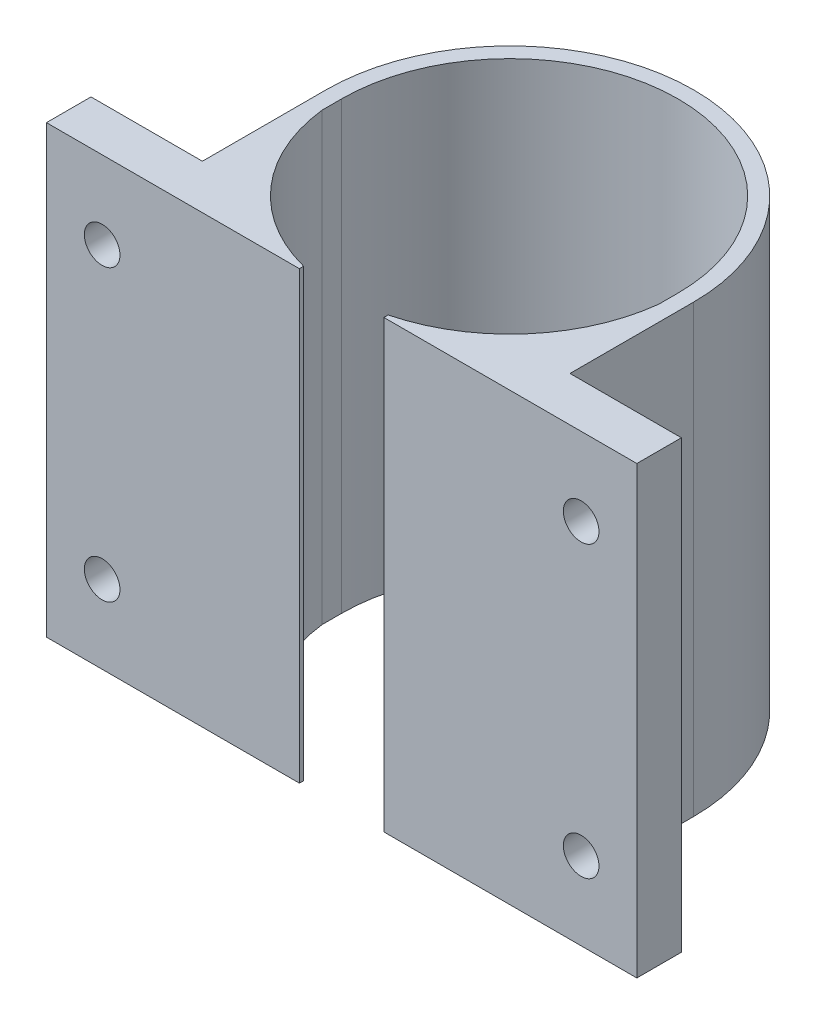
ISO-10303-21;
HEADER;
FILE_DESCRIPTION(('STEP AP214'),'2;1');
FILE_NAME('part.step','',(''),(''),'','','');
FILE_SCHEMA(('AUTOMOTIVE_DESIGN { 1 0 10303 214 1 1 1 1 }'));
ENDSEC;
DATA;
#1=APPLICATION_CONTEXT('core data for automotive mechanical design processes');
#2=APPLICATION_PROTOCOL_DEFINITION('international standard','automotive_design',2000,#1);
#3=PRODUCT_CONTEXT('',#1,'mechanical');
#4=PRODUCT('Part','Part','',(#3));
#5=PRODUCT_RELATED_PRODUCT_CATEGORY('part','',(#4));
#6=PRODUCT_DEFINITION_FORMATION('','',#4);
#7=PRODUCT_DEFINITION_CONTEXT('part definition',#1,'design');
#8=PRODUCT_DEFINITION('design','',#6,#7);
#9=PRODUCT_DEFINITION_SHAPE('','',#8);
#10=(LENGTH_UNIT() NAMED_UNIT(*) SI_UNIT(.MILLI.,.METRE.));
#11=(NAMED_UNIT(*) PLANE_ANGLE_UNIT() SI_UNIT($,.RADIAN.));
#12=(NAMED_UNIT(*) SI_UNIT($,.STERADIAN.) SOLID_ANGLE_UNIT());
#13=UNCERTAINTY_MEASURE_WITH_UNIT(LENGTH_MEASURE(1.E-05),#10,'distance_accuracy_value','');
#14=(GEOMETRIC_REPRESENTATION_CONTEXT(3) GLOBAL_UNCERTAINTY_ASSIGNED_CONTEXT((#13)) GLOBAL_UNIT_ASSIGNED_CONTEXT((#10,
#11,#12)) REPRESENTATION_CONTEXT('',''));
#15=CARTESIAN_POINT('',(0.,0.,0.));
#16=DIRECTION('',(0.,0.,1.));
#17=DIRECTION('',(1.,0.,0.));
#18=AXIS2_PLACEMENT_3D('',#15,#16,#17);
#19=CARTESIAN_POINT('',(-12.08,32.,0.));
#20=DIRECTION('',(1.,0.,0.));
#21=DIRECTION('',(0.,0.,-1.));
#22=AXIS2_PLACEMENT_3D('',#19,#20,#21);
#23=PLANE('',#22);
#24=DIRECTION('',(0.,0.,1.));
#25=VECTOR('',#24,1.);
#26=CARTESIAN_POINT('',(-12.08,32.,0.));
#27=LINE('',#26,#25);
#28=CARTESIAN_POINT('',(-12.08,32.,0.));
#29=VERTEX_POINT('',#28);
#30=CARTESIAN_POINT('',(-12.08,32.,1.39255161484235));
#31=VERTEX_POINT('',#30);
#32=EDGE_CURVE('E297',#29,#31,#27,.T.);
#33=ORIENTED_EDGE('',*,*,#32,.T.);
#34=DIRECTION('',(0.,-1.,0.));
#35=VECTOR('',#34,1.);
#36=CARTESIAN_POINT('',(-12.08,32.,1.39255161484235));
#37=LINE('',#36,#35);
#38=CARTESIAN_POINT('',(-12.08,0.,1.39255161484235));
#39=VERTEX_POINT('',#38);
#40=EDGE_CURVE('E189',#31,#39,#37,.T.);
#41=ORIENTED_EDGE('',*,*,#40,.T.);
#42=DIRECTION('',(0.,0.,1.));
#43=VECTOR('',#42,1.);
#44=CARTESIAN_POINT('',(-12.08,0.,0.));
#45=LINE('',#44,#43);
#46=CARTESIAN_POINT('',(-12.08,0.,0.));
#47=VERTEX_POINT('',#46);
#48=EDGE_CURVE('E322',#47,#39,#45,.T.);
#49=ORIENTED_EDGE('',*,*,#48,.F.);
#50=DIRECTION('',(0.,-1.,0.));
#51=VECTOR('',#50,1.);
#52=CARTESIAN_POINT('',(-12.08,32.,0.));
#53=LINE('',#52,#51);
#54=EDGE_CURVE('E336',#29,#47,#53,.T.);
#55=ORIENTED_EDGE('',*,*,#54,.F.);
#56=EDGE_LOOP('',(#33,#41,#49,#55));
#57=FACE_BOUND('',#56,.T.);
#58=ADVANCED_FACE('F51',(#57),#23,.T.);
#59=CARTESIAN_POINT('',(-13.2,32.,0.));
#60=DIRECTION('',(1.,0.,0.));
#61=DIRECTION('',(0.,0.,-1.));
#62=AXIS2_PLACEMENT_3D('',#59,#60,#61);
#63=PLANE('',#62);
#64=DIRECTION('',(0.,-1.,0.));
#65=VECTOR('',#64,1.);
#66=CARTESIAN_POINT('',(-13.2,32.,8.88));
#67=LINE('',#66,#65);
#68=CARTESIAN_POINT('',(-13.2,32.,8.88));
#69=VERTEX_POINT('',#68);
#70=CARTESIAN_POINT('',(-13.2,0.,8.88));
#71=VERTEX_POINT('',#70);
#72=EDGE_CURVE('E227',#69,#71,#67,.T.);
#73=ORIENTED_EDGE('',*,*,#72,.F.);
#74=DIRECTION('',(0.,0.,1.));
#75=VECTOR('',#74,1.);
#76=CARTESIAN_POINT('',(-13.2,32.,0.));
#77=LINE('',#76,#75);
#78=CARTESIAN_POINT('',(-13.2,32.,0.));
#79=VERTEX_POINT('',#78);
#80=EDGE_CURVE('E291',#79,#69,#77,.T.);
#81=ORIENTED_EDGE('',*,*,#80,.F.);
#82=DIRECTION('',(0.,-1.,0.));
#83=VECTOR('',#82,1.);
#84=CARTESIAN_POINT('',(-13.2,32.,0.));
#85=LINE('',#84,#83);
#86=CARTESIAN_POINT('',(-13.2,0.,0.));
#87=VERTEX_POINT('',#86);
#88=EDGE_CURVE('E60',#79,#87,#85,.T.);
#89=ORIENTED_EDGE('',*,*,#88,.T.);
#90=DIRECTION('',(0.,0.,1.));
#91=VECTOR('',#90,1.);
#92=CARTESIAN_POINT('',(-13.2,0.,0.));
#93=LINE('',#92,#91);
#94=EDGE_CURVE('E316',#87,#71,#93,.T.);
#95=ORIENTED_EDGE('',*,*,#94,.T.);
#96=EDGE_LOOP('',(#73,#81,#89,#95));
#97=FACE_BOUND('',#96,.T.);
#98=ADVANCED_FACE('F344',(#97),#63,.F.);
#99=CARTESIAN_POINT('',(13.2,32.,0.));
#100=DIRECTION('',(-1.,0.,0.));
#101=DIRECTION('',(0.,0.,1.));
#102=AXIS2_PLACEMENT_3D('',#99,#100,#101);
#103=PLANE('',#102);
#104=DIRECTION('',(0.,1.,0.));
#105=VECTOR('',#104,1.);
#106=CARTESIAN_POINT('',(13.2,0.,8.88));
#107=LINE('',#106,#105);
#108=CARTESIAN_POINT('',(13.2,0.,8.88));
#109=VERTEX_POINT('',#108);
#110=CARTESIAN_POINT('',(13.2,32.,8.88));
#111=VERTEX_POINT('',#110);
#112=EDGE_CURVE('E257',#109,#111,#107,.T.);
#113=ORIENTED_EDGE('',*,*,#112,.F.);
#114=DIRECTION('',(0.,0.,-1.));
#115=VECTOR('',#114,1.);
#116=CARTESIAN_POINT('',(13.2,0.,0.));
#117=LINE('',#116,#115);
#118=CARTESIAN_POINT('',(13.2,0.,0.));
#119=VERTEX_POINT('',#118);
#120=EDGE_CURVE('E283',#109,#119,#117,.T.);
#121=ORIENTED_EDGE('',*,*,#120,.T.);
#122=DIRECTION('',(0.,-1.,0.));
#123=VECTOR('',#122,1.);
#124=CARTESIAN_POINT('',(13.2,32.,0.));
#125=LINE('',#124,#123);
#126=CARTESIAN_POINT('',(13.2,32.,0.));
#127=VERTEX_POINT('',#126);
#128=EDGE_CURVE('E12',#127,#119,#125,.T.);
#129=ORIENTED_EDGE('',*,*,#128,.F.);
#130=DIRECTION('',(0.,0.,-1.));
#131=VECTOR('',#130,1.);
#132=CARTESIAN_POINT('',(13.2,32.,0.));
#133=LINE('',#132,#131);
#134=EDGE_CURVE('E284',#111,#127,#133,.T.);
#135=ORIENTED_EDGE('',*,*,#134,.F.);
#136=EDGE_LOOP('',(#113,#121,#129,#135));
#137=FACE_BOUND('',#136,.T.);
#138=ADVANCED_FACE('F53',(#137),#103,.F.);
#139=CARTESIAN_POINT('',(0.,32.,0.));
#140=DIRECTION('',(0.,-1.,0.));
#141=DIRECTION('',(0.,0.,-1.));
#142=AXIS2_PLACEMENT_3D('',#139,#140,#141);
#143=CYLINDRICAL_SURFACE('',#142,13.2);
#144=CARTESIAN_POINT('',(0.,0.,0.));
#145=DIRECTION('',(0.,1.,0.));
#146=DIRECTION('',(0.,0.,1.));
#147=AXIS2_PLACEMENT_3D('',#144,#145,#146);
#148=CIRCLE('',#147,13.2);
#149=EDGE_CURVE('E313',#119,#87,#148,.T.);
#150=ORIENTED_EDGE('',*,*,#149,.T.);
#151=ORIENTED_EDGE('',*,*,#88,.F.);
#152=CARTESIAN_POINT('',(0.,32.,0.));
#153=DIRECTION('',(0.,1.,0.));
#154=DIRECTION('',(0.,0.,1.));
#155=AXIS2_PLACEMENT_3D('',#152,#153,#154);
#156=CIRCLE('',#155,13.2);
#157=EDGE_CURVE('E287',#127,#79,#156,.T.);
#158=ORIENTED_EDGE('',*,*,#157,.F.);
#159=ORIENTED_EDGE('',*,*,#128,.T.);
#160=EDGE_LOOP('',(#150,#151,#158,#159));
#161=FACE_BOUND('',#160,.T.);
#162=ADVANCED_FACE('F357',(#161),#143,.T.);
#163=CARTESIAN_POINT('',(0.,32.,12.08));
#164=DIRECTION('',(0.,0.,1.));
#165=DIRECTION('',(1.,0.,0.));
#166=AXIS2_PLACEMENT_3D('',#163,#164,#165);
#167=PLANE('',#166);
#168=CARTESIAN_POINT('',(-17.2,5.6,12.08));
#169=DIRECTION('',(0.,0.,1.));
#170=DIRECTION('',(1.,0.,0.));
#171=AXIS2_PLACEMENT_3D('',#168,#169,#170);
#172=CIRCLE('',#171,1.28);
#173=CARTESIAN_POINT('',(-15.92,5.6,12.08));
#174=VERTEX_POINT('',#173);
#175=EDGE_CURVE('E456',#174,#174,#172,.T.);
#176=ORIENTED_EDGE('',*,*,#175,.F.);
#177=EDGE_LOOP('',(#176));
#178=FACE_BOUND('',#177,.T.);
#179=CARTESIAN_POINT('',(-17.2,26.4,12.08));
#180=DIRECTION('',(0.,0.,1.));
#181=DIRECTION('',(1.,0.,0.));
#182=AXIS2_PLACEMENT_3D('',#179,#180,#181);
#183=CIRCLE('',#182,1.28);
#184=CARTESIAN_POINT('',(-15.92,26.4,12.08));
#185=VERTEX_POINT('',#184);
#186=EDGE_CURVE('E467',#185,#185,#183,.T.);
#187=ORIENTED_EDGE('',*,*,#186,.F.);
#188=EDGE_LOOP('',(#187));
#189=FACE_BOUND('',#188,.T.);
#190=DIRECTION('',(-1.,0.,0.));
#191=VECTOR('',#190,1.);
#192=CARTESIAN_POINT('',(0.,0.,12.08));
#193=LINE('',#192,#191);
#194=CARTESIAN_POINT('',(-3.03306616692718,0.,12.08));
#195=VERTEX_POINT('',#194);
#196=CARTESIAN_POINT('',(-21.2,0.,12.08));
#197=VERTEX_POINT('',#196);
#198=EDGE_CURVE('E319',#195,#197,#193,.T.);
#199=ORIENTED_EDGE('',*,*,#198,.F.);
#200=DIRECTION('',(0.,-1.,0.));
#201=VECTOR('',#200,1.);
#202=CARTESIAN_POINT('',(-3.03306616692718,32.,12.08));
#203=LINE('',#202,#201);
#204=CARTESIAN_POINT('',(-3.03306616692718,32.,12.08));
#205=VERTEX_POINT('',#204);
#206=EDGE_CURVE('E185',#205,#195,#203,.T.);
#207=ORIENTED_EDGE('',*,*,#206,.F.);
#208=DIRECTION('',(-1.,0.,0.));
#209=VECTOR('',#208,1.);
#210=CARTESIAN_POINT('',(0.,32.,12.08));
#211=LINE('',#210,#209);
#212=CARTESIAN_POINT('',(-21.2,32.,12.08));
#213=VERTEX_POINT('',#212);
#214=EDGE_CURVE('E171',#205,#213,#211,.T.);
#215=ORIENTED_EDGE('',*,*,#214,.T.);
#216=DIRECTION('',(0.,1.,0.));
#217=VECTOR('',#216,1.);
#218=CARTESIAN_POINT('',(-21.2,32.,12.08));
#219=LINE('',#218,#217);
#220=EDGE_CURVE('E232',#197,#213,#219,.T.);
#221=ORIENTED_EDGE('',*,*,#220,.F.);
#222=EDGE_LOOP('',(#199,#207,#215,#221));
#223=FACE_BOUND('',#222,.T.);
#224=ADVANCED_FACE('F392',(#178,#189,#223),#167,.T.);
#225=CARTESIAN_POINT('',(0.,32.,0.));
#226=DIRECTION('',(0.,-1.,0.));
#227=DIRECTION('',(0.,0.,-1.));
#228=AXIS2_PLACEMENT_3D('',#225,#226,#227);
#229=CYLINDRICAL_SURFACE('',#228,12.08);
#230=CARTESIAN_POINT('',(0.,0.,0.));
#231=DIRECTION('',(0.,1.,0.));
#232=DIRECTION('',(0.,0.,1.));
#233=AXIS2_PLACEMENT_3D('',#230,#231,#232);
#234=CIRCLE('',#233,12.08);
#235=CARTESIAN_POINT('',(12.08,0.,0.));
#236=VERTEX_POINT('',#235);
#237=EDGE_CURVE('E326',#236,#47,#234,.T.);
#238=ORIENTED_EDGE('',*,*,#237,.F.);
#239=DIRECTION('',(0.,-1.,0.));
#240=VECTOR('',#239,1.);
#241=CARTESIAN_POINT('',(12.08,32.,0.));
#242=LINE('',#241,#240);
#243=CARTESIAN_POINT('',(12.08,32.,0.));
#244=VERTEX_POINT('',#243);
#245=EDGE_CURVE('E310',#244,#236,#242,.T.);
#246=ORIENTED_EDGE('',*,*,#245,.F.);
#247=CARTESIAN_POINT('',(0.,32.,0.));
#248=DIRECTION('',(0.,1.,0.));
#249=DIRECTION('',(0.,0.,1.));
#250=AXIS2_PLACEMENT_3D('',#247,#248,#249);
#251=CIRCLE('',#250,12.08);
#252=EDGE_CURVE('E300',#244,#29,#251,.T.);
#253=ORIENTED_EDGE('',*,*,#252,.T.);
#254=ORIENTED_EDGE('',*,*,#54,.T.);
#255=EDGE_LOOP('',(#238,#246,#253,#254));
#256=FACE_BOUND('',#255,.T.);
#257=ADVANCED_FACE('F385',(#256),#229,.F.);
#258=CARTESIAN_POINT('',(12.08,32.,0.));
#259=DIRECTION('',(1.,0.,0.));
#260=DIRECTION('',(0.,0.,-1.));
#261=AXIS2_PLACEMENT_3D('',#258,#259,#260);
#262=PLANE('',#261);
#263=DIRECTION('',(0.,0.,1.));
#264=VECTOR('',#263,1.);
#265=CARTESIAN_POINT('',(12.08,0.,0.));
#266=LINE('',#265,#264);
#267=CARTESIAN_POINT('',(12.08,0.,1.39255161484233));
#268=VERTEX_POINT('',#267);
#269=EDGE_CURVE('E72',#236,#268,#266,.T.);
#270=ORIENTED_EDGE('',*,*,#269,.T.);
#271=DIRECTION('',(0.,-1.,0.));
#272=VECTOR('',#271,1.);
#273=CARTESIAN_POINT('',(12.08,32.,1.39255161484235));
#274=LINE('',#273,#272);
#275=CARTESIAN_POINT('',(12.08,32.,1.39255161484233));
#276=VERTEX_POINT('',#275);
#277=EDGE_CURVE('E67',#276,#268,#274,.T.);
#278=ORIENTED_EDGE('',*,*,#277,.F.);
#279=DIRECTION('',(0.,0.,1.));
#280=VECTOR('',#279,1.);
#281=CARTESIAN_POINT('',(12.08,32.,0.));
#282=LINE('',#281,#280);
#283=EDGE_CURVE('E304',#244,#276,#282,.T.);
#284=ORIENTED_EDGE('',*,*,#283,.F.);
#285=ORIENTED_EDGE('',*,*,#245,.T.);
#286=EDGE_LOOP('',(#270,#278,#284,#285));
#287=FACE_BOUND('',#286,.T.);
#288=ADVANCED_FACE('F382',(#287),#262,.F.);
#289=CARTESIAN_POINT('',(0.,32.,12.08));
#290=DIRECTION('',(0.,0.,-1.));
#291=DIRECTION('',(-1.,0.,0.));
#292=AXIS2_PLACEMENT_3D('',#289,#290,#291);
#293=PLANE('',#292);
#294=CARTESIAN_POINT('',(17.2,26.4,12.08));
#295=DIRECTION('',(0.,0.,-1.));
#296=DIRECTION('',(-1.,0.,0.));
#297=AXIS2_PLACEMENT_3D('',#294,#295,#296);
#298=CIRCLE('',#297,1.28);
#299=CARTESIAN_POINT('',(15.92,26.4,12.08));
#300=VERTEX_POINT('',#299);
#301=EDGE_CURVE('E197',#300,#300,#298,.T.);
#302=ORIENTED_EDGE('',*,*,#301,.T.);
#303=EDGE_LOOP('',(#302));
#304=FACE_BOUND('',#303,.T.);
#305=CARTESIAN_POINT('',(17.2,5.6,12.08));
#306=DIRECTION('',(0.,0.,-1.));
#307=DIRECTION('',(-1.,0.,0.));
#308=AXIS2_PLACEMENT_3D('',#305,#306,#307);
#309=CIRCLE('',#308,1.28);
#310=CARTESIAN_POINT('',(15.92,5.6,12.08));
#311=VERTEX_POINT('',#310);
#312=EDGE_CURVE('E480',#311,#311,#309,.T.);
#313=ORIENTED_EDGE('',*,*,#312,.T.);
#314=EDGE_LOOP('',(#313));
#315=FACE_BOUND('',#314,.T.);
#316=DIRECTION('',(1.,0.,0.));
#317=VECTOR('',#316,1.);
#318=CARTESIAN_POINT('',(0.,0.,12.08));
#319=LINE('',#318,#317);
#320=CARTESIAN_POINT('',(3.03306616692718,0.,12.08));
#321=VERTEX_POINT('',#320);
#322=CARTESIAN_POINT('',(21.2,0.,12.08));
#323=VERTEX_POINT('',#322);
#324=EDGE_CURVE('E288',#321,#323,#319,.T.);
#325=ORIENTED_EDGE('',*,*,#324,.T.);
#326=DIRECTION('',(0.,-1.,0.));
#327=VECTOR('',#326,1.);
#328=CARTESIAN_POINT('',(21.2,0.,12.08));
#329=LINE('',#328,#327);
#330=CARTESIAN_POINT('',(21.2,32.,12.08));
#331=VERTEX_POINT('',#330);
#332=EDGE_CURVE('E258',#331,#323,#329,.T.);
#333=ORIENTED_EDGE('',*,*,#332,.F.);
#334=DIRECTION('',(1.,0.,0.));
#335=VECTOR('',#334,1.);
#336=CARTESIAN_POINT('',(0.,32.,12.08));
#337=LINE('',#336,#335);
#338=CARTESIAN_POINT('',(3.03306616692718,32.,12.08));
#339=VERTEX_POINT('',#338);
#340=EDGE_CURVE('E307',#339,#331,#337,.T.);
#341=ORIENTED_EDGE('',*,*,#340,.F.);
#342=DIRECTION('',(0.,-1.,0.));
#343=VECTOR('',#342,1.);
#344=CARTESIAN_POINT('',(3.03306616692718,32.,12.08));
#345=LINE('',#344,#343);
#346=EDGE_CURVE('E223',#339,#321,#345,.T.);
#347=ORIENTED_EDGE('',*,*,#346,.T.);
#348=EDGE_LOOP('',(#325,#333,#341,#347));
#349=FACE_BOUND('',#348,.T.);
#350=ADVANCED_FACE('F371',(#304,#315,#349),#293,.F.);
#351=CARTESIAN_POINT('',(0.,32.,0.));
#352=DIRECTION('',(0.,1.,0.));
#353=DIRECTION('',(0.,0.,1.));
#354=AXIS2_PLACEMENT_3D('',#351,#352,#353);
#355=PLANE('',#354);
#356=ORIENTED_EDGE('',*,*,#340,.T.);
#357=DIRECTION('',(0.,0.,1.));
#358=VECTOR('',#357,1.);
#359=CARTESIAN_POINT('',(21.2,32.,12.08));
#360=LINE('',#359,#358);
#361=CARTESIAN_POINT('',(21.2,32.,8.88));
#362=VERTEX_POINT('',#361);
#363=EDGE_CURVE('E268',#362,#331,#360,.T.);
#364=ORIENTED_EDGE('',*,*,#363,.F.);
#365=DIRECTION('',(-1.,0.,0.));
#366=VECTOR('',#365,1.);
#367=CARTESIAN_POINT('',(21.2,32.,8.88));
#368=LINE('',#367,#366);
#369=EDGE_CURVE('E272',#362,#111,#368,.T.);
#370=ORIENTED_EDGE('',*,*,#369,.T.);
#371=ORIENTED_EDGE('',*,*,#134,.T.);
#372=ORIENTED_EDGE('',*,*,#157,.T.);
#373=ORIENTED_EDGE('',*,*,#80,.T.);
#374=DIRECTION('',(1.,0.,0.));
#375=VECTOR('',#374,1.);
#376=CARTESIAN_POINT('',(-21.2,32.,8.88));
#377=LINE('',#376,#375);
#378=CARTESIAN_POINT('',(-21.2,32.,8.88));
#379=VERTEX_POINT('',#378);
#380=EDGE_CURVE('E253',#379,#69,#377,.T.);
#381=ORIENTED_EDGE('',*,*,#380,.F.);
#382=DIRECTION('',(0.,0.,-1.));
#383=VECTOR('',#382,1.);
#384=CARTESIAN_POINT('',(-21.2,32.,12.08));
#385=LINE('',#384,#383);
#386=EDGE_CURVE('E236',#213,#379,#385,.T.);
#387=ORIENTED_EDGE('',*,*,#386,.F.);
#388=ORIENTED_EDGE('',*,*,#214,.F.);
#389=DIRECTION('',(0.,0.,-1.));
#390=VECTOR('',#389,1.);
#391=CARTESIAN_POINT('',(-3.03306616692718,32.,0.));
#392=LINE('',#391,#390);
#393=CARTESIAN_POINT('',(-3.03306616692718,32.,11.775657502961));
#394=VERTEX_POINT('',#393);
#395=EDGE_CURVE('E163',#205,#394,#392,.T.);
#396=ORIENTED_EDGE('',*,*,#395,.T.);
#397=CARTESIAN_POINT('',(0.,32.,0.));
#398=DIRECTION('',(0.,-1.,0.));
#399=DIRECTION('',(0.,0.,-1.));
#400=AXIS2_PLACEMENT_3D('',#397,#398,#399);
#401=CIRCLE('',#400,12.16);
#402=EDGE_CURVE('E168',#394,#31,#401,.T.);
#403=ORIENTED_EDGE('',*,*,#402,.T.);
#404=ORIENTED_EDGE('',*,*,#32,.F.);
#405=ORIENTED_EDGE('',*,*,#252,.F.);
#406=ORIENTED_EDGE('',*,*,#283,.T.);
#407=CARTESIAN_POINT('',(0.,32.,0.));
#408=DIRECTION('',(0.,-1.,0.));
#409=DIRECTION('',(0.,0.,-1.));
#410=AXIS2_PLACEMENT_3D('',#407,#408,#409);
#411=CIRCLE('',#410,12.16);
#412=CARTESIAN_POINT('',(3.03306616692718,32.,11.775657502961));
#413=VERTEX_POINT('',#412);
#414=EDGE_CURVE('E211',#413,#276,#411,.F.);
#415=ORIENTED_EDGE('',*,*,#414,.F.);
#416=DIRECTION('',(0.,0.,-1.));
#417=VECTOR('',#416,1.);
#418=CARTESIAN_POINT('',(3.03306616692718,32.,0.));
#419=LINE('',#418,#417);
#420=EDGE_CURVE('E207',#339,#413,#419,.T.);
#421=ORIENTED_EDGE('',*,*,#420,.F.);
#422=EDGE_LOOP('',(#356,#364,#370,#371,#372,#373,#381,#387,#388,#396,#403,#404,#405,#406,#415,#421));
#423=FACE_BOUND('',#422,.T.);
#424=ADVANCED_FACE('F165',(#423),#355,.T.);
#425=CARTESIAN_POINT('',(0.,0.,0.));
#426=DIRECTION('',(0.,1.,0.));
#427=DIRECTION('',(0.,0.,1.));
#428=AXIS2_PLACEMENT_3D('',#425,#426,#427);
#429=PLANE('',#428);
#430=ORIENTED_EDGE('',*,*,#120,.F.);
#431=DIRECTION('',(-1.,0.,0.));
#432=VECTOR('',#431,1.);
#433=CARTESIAN_POINT('',(21.2,0.,8.88));
#434=LINE('',#433,#432);
#435=CARTESIAN_POINT('',(21.2,0.,8.88));
#436=VERTEX_POINT('',#435);
#437=EDGE_CURVE('E279',#436,#109,#434,.T.);
#438=ORIENTED_EDGE('',*,*,#437,.F.);
#439=DIRECTION('',(0.,0.,-1.));
#440=VECTOR('',#439,1.);
#441=CARTESIAN_POINT('',(21.2,0.,12.08));
#442=LINE('',#441,#440);
#443=EDGE_CURVE('E262',#323,#436,#442,.T.);
#444=ORIENTED_EDGE('',*,*,#443,.F.);
#445=ORIENTED_EDGE('',*,*,#324,.F.);
#446=DIRECTION('',(0.,0.,-1.));
#447=VECTOR('',#446,1.);
#448=CARTESIAN_POINT('',(3.03306616692718,0.,0.));
#449=LINE('',#448,#447);
#450=CARTESIAN_POINT('',(3.03306616692718,0.,11.775657502961));
#451=VERTEX_POINT('',#450);
#452=EDGE_CURVE('E204',#321,#451,#449,.T.);
#453=ORIENTED_EDGE('',*,*,#452,.T.);
#454=CARTESIAN_POINT('',(0.,0.,0.));
#455=DIRECTION('',(0.,-1.,0.));
#456=DIRECTION('',(0.,0.,-1.));
#457=AXIS2_PLACEMENT_3D('',#454,#455,#456);
#458=CIRCLE('',#457,12.16);
#459=EDGE_CURVE('E212',#451,#268,#458,.F.);
#460=ORIENTED_EDGE('',*,*,#459,.T.);
#461=ORIENTED_EDGE('',*,*,#269,.F.);
#462=ORIENTED_EDGE('',*,*,#237,.T.);
#463=ORIENTED_EDGE('',*,*,#48,.T.);
#464=CARTESIAN_POINT('',(0.,0.,0.));
#465=DIRECTION('',(0.,-1.,0.));
#466=DIRECTION('',(0.,0.,-1.));
#467=AXIS2_PLACEMENT_3D('',#464,#465,#466);
#468=CIRCLE('',#467,12.16);
#469=CARTESIAN_POINT('',(-3.03306616692718,0.,11.775657502961));
#470=VERTEX_POINT('',#469);
#471=EDGE_CURVE('E194',#470,#39,#468,.T.);
#472=ORIENTED_EDGE('',*,*,#471,.F.);
#473=DIRECTION('',(0.,0.,-1.));
#474=VECTOR('',#473,1.);
#475=CARTESIAN_POINT('',(-3.03306616692718,0.,0.));
#476=LINE('',#475,#474);
#477=EDGE_CURVE('E181',#195,#470,#476,.T.);
#478=ORIENTED_EDGE('',*,*,#477,.F.);
#479=ORIENTED_EDGE('',*,*,#198,.T.);
#480=DIRECTION('',(0.,0.,1.));
#481=VECTOR('',#480,1.);
#482=CARTESIAN_POINT('',(-21.2,0.,12.08));
#483=LINE('',#482,#481);
#484=CARTESIAN_POINT('',(-21.2,0.,8.88));
#485=VERTEX_POINT('',#484);
#486=EDGE_CURVE('E242',#485,#197,#483,.T.);
#487=ORIENTED_EDGE('',*,*,#486,.F.);
#488=DIRECTION('',(1.,0.,0.));
#489=VECTOR('',#488,1.);
#490=CARTESIAN_POINT('',(-21.2,0.,8.88));
#491=LINE('',#490,#489);
#492=EDGE_CURVE('E246',#485,#71,#491,.T.);
#493=ORIENTED_EDGE('',*,*,#492,.T.);
#494=ORIENTED_EDGE('',*,*,#94,.F.);
#495=ORIENTED_EDGE('',*,*,#149,.F.);
#496=EDGE_LOOP('',(#430,#438,#444,#445,#453,#460,#461,#462,#463,#472,#478,#479,#487,#493,#494,#495));
#497=FACE_BOUND('',#496,.T.);
#498=ADVANCED_FACE('F349',(#497),#429,.F.);
#499=CARTESIAN_POINT('',(21.2,0.,8.88));
#500=DIRECTION('',(0.,0.,1.));
#501=DIRECTION('',(1.,0.,0.));
#502=AXIS2_PLACEMENT_3D('',#499,#500,#501);
#503=PLANE('',#502);
#504=CARTESIAN_POINT('',(17.2,26.4,8.88));
#505=DIRECTION('',(0.,0.,-1.));
#506=DIRECTION('',(-1.,0.,0.));
#507=AXIS2_PLACEMENT_3D('',#504,#505,#506);
#508=CIRCLE('',#507,1.28);
#509=CARTESIAN_POINT('',(15.92,26.4,8.88));
#510=VERTEX_POINT('',#509);
#511=EDGE_CURVE('E470',#510,#510,#508,.T.);
#512=ORIENTED_EDGE('',*,*,#511,.F.);
#513=EDGE_LOOP('',(#512));
#514=FACE_BOUND('',#513,.T.);
#515=CARTESIAN_POINT('',(17.2,5.6,8.88));
#516=DIRECTION('',(0.,0.,-1.));
#517=DIRECTION('',(-1.,0.,0.));
#518=AXIS2_PLACEMENT_3D('',#515,#516,#517);
#519=CIRCLE('',#518,1.28);
#520=CARTESIAN_POINT('',(15.92,5.6,8.88));
#521=VERTEX_POINT('',#520);
#522=EDGE_CURVE('E462',#521,#521,#519,.T.);
#523=ORIENTED_EDGE('',*,*,#522,.F.);
#524=EDGE_LOOP('',(#523));
#525=FACE_BOUND('',#524,.T.);
#526=ORIENTED_EDGE('',*,*,#112,.T.);
#527=ORIENTED_EDGE('',*,*,#369,.F.);
#528=DIRECTION('',(0.,1.,0.));
#529=VECTOR('',#528,1.);
#530=CARTESIAN_POINT('',(21.2,0.,8.88));
#531=LINE('',#530,#529);
#532=EDGE_CURVE('E265',#436,#362,#531,.T.);
#533=ORIENTED_EDGE('',*,*,#532,.F.);
#534=ORIENTED_EDGE('',*,*,#437,.T.);
#535=EDGE_LOOP('',(#526,#527,#533,#534));
#536=FACE_BOUND('',#535,.T.);
#537=ADVANCED_FACE('F365',(#514,#525,#536),#503,.F.);
#538=CARTESIAN_POINT('',(21.2,0.,0.));
#539=DIRECTION('',(-1.,0.,0.));
#540=DIRECTION('',(0.,0.,1.));
#541=AXIS2_PLACEMENT_3D('',#538,#539,#540);
#542=PLANE('',#541);
#543=ORIENTED_EDGE('',*,*,#332,.T.);
#544=ORIENTED_EDGE('',*,*,#443,.T.);
#545=ORIENTED_EDGE('',*,*,#532,.T.);
#546=ORIENTED_EDGE('',*,*,#363,.T.);
#547=EDGE_LOOP('',(#543,#544,#545,#546));
#548=FACE_BOUND('',#547,.T.);
#549=ADVANCED_FACE('F368',(#548),#542,.F.);
#550=CARTESIAN_POINT('',(-21.2,32.,8.88));
#551=DIRECTION('',(0.,0.,1.));
#552=DIRECTION('',(0.,-1.,0.));
#553=AXIS2_PLACEMENT_3D('',#550,#551,#552);
#554=PLANE('',#553);
#555=CARTESIAN_POINT('',(-17.2,5.6,8.88));
#556=DIRECTION('',(0.,0.,-1.));
#557=DIRECTION('',(-1.,0.,0.));
#558=AXIS2_PLACEMENT_3D('',#555,#556,#557);
#559=CIRCLE('',#558,1.28);
#560=CARTESIAN_POINT('',(-18.48,5.6,8.88));
#561=VERTEX_POINT('',#560);
#562=EDGE_CURVE('E459',#561,#561,#559,.T.);
#563=ORIENTED_EDGE('',*,*,#562,.F.);
#564=EDGE_LOOP('',(#563));
#565=FACE_BOUND('',#564,.T.);
#566=CARTESIAN_POINT('',(-17.2,26.4,8.88));
#567=DIRECTION('',(0.,0.,-1.));
#568=DIRECTION('',(-1.,0.,0.));
#569=AXIS2_PLACEMENT_3D('',#566,#567,#568);
#570=CIRCLE('',#569,1.28);
#571=CARTESIAN_POINT('',(-18.48,26.4,8.88));
#572=VERTEX_POINT('',#571);
#573=EDGE_CURVE('E461',#572,#572,#570,.T.);
#574=ORIENTED_EDGE('',*,*,#573,.F.);
#575=EDGE_LOOP('',(#574));
#576=FACE_BOUND('',#575,.T.);
#577=ORIENTED_EDGE('',*,*,#72,.T.);
#578=ORIENTED_EDGE('',*,*,#492,.F.);
#579=DIRECTION('',(0.,-1.,0.));
#580=VECTOR('',#579,1.);
#581=CARTESIAN_POINT('',(-21.2,32.,8.88));
#582=LINE('',#581,#580);
#583=EDGE_CURVE('E239',#379,#485,#582,.T.);
#584=ORIENTED_EDGE('',*,*,#583,.F.);
#585=ORIENTED_EDGE('',*,*,#380,.T.);
#586=EDGE_LOOP('',(#577,#578,#584,#585));
#587=FACE_BOUND('',#586,.T.);
#588=ADVANCED_FACE('F354',(#565,#576,#587),#554,.F.);
#589=CARTESIAN_POINT('',(-21.2,0.,0.));
#590=DIRECTION('',(1.,0.,0.));
#591=DIRECTION('',(0.,0.,-1.));
#592=AXIS2_PLACEMENT_3D('',#589,#590,#591);
#593=PLANE('',#592);
#594=ORIENTED_EDGE('',*,*,#220,.T.);
#595=ORIENTED_EDGE('',*,*,#386,.T.);
#596=ORIENTED_EDGE('',*,*,#583,.T.);
#597=ORIENTED_EDGE('',*,*,#486,.T.);
#598=EDGE_LOOP('',(#594,#595,#596,#597));
#599=FACE_BOUND('',#598,.T.);
#600=ADVANCED_FACE('F391',(#599),#593,.F.);
#601=CARTESIAN_POINT('',(3.03306616692718,32.,0.));
#602=DIRECTION('',(-1.,0.,0.));
#603=DIRECTION('',(0.,0.,1.));
#604=AXIS2_PLACEMENT_3D('',#601,#602,#603);
#605=PLANE('',#604);
#606=ORIENTED_EDGE('',*,*,#452,.F.);
#607=ORIENTED_EDGE('',*,*,#346,.F.);
#608=ORIENTED_EDGE('',*,*,#420,.T.);
#609=DIRECTION('',(0.,-1.,0.));
#610=VECTOR('',#609,1.);
#611=CARTESIAN_POINT('',(3.03306616692718,32.,11.775657502961));
#612=LINE('',#611,#610);
#613=EDGE_CURVE('E216',#413,#451,#612,.T.);
#614=ORIENTED_EDGE('',*,*,#613,.T.);
#615=EDGE_LOOP('',(#606,#607,#608,#614));
#616=FACE_BOUND('',#615,.T.);
#617=ADVANCED_FACE('F376',(#616),#605,.T.);
#618=CARTESIAN_POINT('',(0.,32.,0.));
#619=DIRECTION('',(0.,-1.,0.));
#620=DIRECTION('',(0.,0.,-1.));
#621=AXIS2_PLACEMENT_3D('',#618,#619,#620);
#622=CYLINDRICAL_SURFACE('',#621,12.16);
#623=ORIENTED_EDGE('',*,*,#459,.F.);
#624=ORIENTED_EDGE('',*,*,#613,.F.);
#625=ORIENTED_EDGE('',*,*,#414,.T.);
#626=ORIENTED_EDGE('',*,*,#277,.T.);
#627=EDGE_LOOP('',(#623,#624,#625,#626));
#628=FACE_BOUND('',#627,.T.);
#629=ADVANCED_FACE('F380',(#628),#622,.F.);
#630=CARTESIAN_POINT('',(0.,32.,0.));
#631=DIRECTION('',(0.,-1.,0.));
#632=DIRECTION('',(0.,0.,-1.));
#633=AXIS2_PLACEMENT_3D('',#630,#631,#632);
#634=CYLINDRICAL_SURFACE('',#633,12.16);
#635=ORIENTED_EDGE('',*,*,#471,.T.);
#636=ORIENTED_EDGE('',*,*,#40,.F.);
#637=ORIENTED_EDGE('',*,*,#402,.F.);
#638=DIRECTION('',(0.,-1.,0.));
#639=VECTOR('',#638,1.);
#640=CARTESIAN_POINT('',(-3.03306616692718,32.,11.775657502961));
#641=LINE('',#640,#639);
#642=EDGE_CURVE('E176',#394,#470,#641,.T.);
#643=ORIENTED_EDGE('',*,*,#642,.T.);
#644=EDGE_LOOP('',(#635,#636,#637,#643));
#645=FACE_BOUND('',#644,.T.);
#646=ADVANCED_FACE('F187',(#645),#634,.F.);
#647=CARTESIAN_POINT('',(-3.03306616692718,32.,0.));
#648=DIRECTION('',(-1.,0.,0.));
#649=DIRECTION('',(0.,0.,1.));
#650=AXIS2_PLACEMENT_3D('',#647,#648,#649);
#651=PLANE('',#650);
#652=ORIENTED_EDGE('',*,*,#477,.T.);
#653=ORIENTED_EDGE('',*,*,#642,.F.);
#654=ORIENTED_EDGE('',*,*,#395,.F.);
#655=ORIENTED_EDGE('',*,*,#206,.T.);
#656=EDGE_LOOP('',(#652,#653,#654,#655));
#657=FACE_BOUND('',#656,.T.);
#658=ADVANCED_FACE('F179',(#657),#651,.F.);
#659=CARTESIAN_POINT('',(-17.2,26.4,40.88));
#660=DIRECTION('',(0.,0.,-1.));
#661=DIRECTION('',(-1.,0.,0.));
#662=AXIS2_PLACEMENT_3D('',#659,#660,#661);
#663=CYLINDRICAL_SURFACE('',#662,1.28);
#664=ORIENTED_EDGE('',*,*,#186,.T.);
#665=EDGE_LOOP('',(#664));
#666=FACE_BOUND('',#665,.T.);
#667=ORIENTED_EDGE('',*,*,#573,.T.);
#668=EDGE_LOOP('',(#667));
#669=FACE_BOUND('',#668,.T.);
#670=ADVANCED_FACE('F437',(#666,#669),#663,.F.);
#671=CARTESIAN_POINT('',(-17.2,5.6,40.88));
#672=DIRECTION('',(0.,0.,-1.));
#673=DIRECTION('',(-1.,0.,0.));
#674=AXIS2_PLACEMENT_3D('',#671,#672,#673);
#675=CYLINDRICAL_SURFACE('',#674,1.28);
#676=ORIENTED_EDGE('',*,*,#175,.T.);
#677=EDGE_LOOP('',(#676));
#678=FACE_BOUND('',#677,.T.);
#679=ORIENTED_EDGE('',*,*,#562,.T.);
#680=EDGE_LOOP('',(#679));
#681=FACE_BOUND('',#680,.T.);
#682=ADVANCED_FACE('F440',(#678,#681),#675,.F.);
#683=CARTESIAN_POINT('',(17.2,5.6,40.88));
#684=DIRECTION('',(0.,0.,-1.));
#685=DIRECTION('',(-1.,0.,0.));
#686=AXIS2_PLACEMENT_3D('',#683,#684,#685);
#687=CYLINDRICAL_SURFACE('',#686,1.28);
#688=ORIENTED_EDGE('',*,*,#522,.T.);
#689=EDGE_LOOP('',(#688));
#690=FACE_BOUND('',#689,.T.);
#691=ORIENTED_EDGE('',*,*,#312,.F.);
#692=EDGE_LOOP('',(#691));
#693=FACE_BOUND('',#692,.T.);
#694=ADVANCED_FACE('F445',(#690,#693),#687,.F.);
#695=CARTESIAN_POINT('',(17.2,26.4,40.88));
#696=DIRECTION('',(0.,0.,-1.));
#697=DIRECTION('',(-1.,0.,0.));
#698=AXIS2_PLACEMENT_3D('',#695,#696,#697);
#699=CYLINDRICAL_SURFACE('',#698,1.28);
#700=ORIENTED_EDGE('',*,*,#511,.T.);
#701=EDGE_LOOP('',(#700));
#702=FACE_BOUND('',#701,.T.);
#703=ORIENTED_EDGE('',*,*,#301,.F.);
#704=EDGE_LOOP('',(#703));
#705=FACE_BOUND('',#704,.T.);
#706=ADVANCED_FACE('F442',(#702,#705),#699,.F.);
#707=CLOSED_SHELL('',(#58,#98,#138,#162,#224,#257,#288,#350,#424,#498,#537,#549,#588,#600,#617,
#629,#646,#658,#670,#682,#694,#706));
#708=MANIFOLD_SOLID_BREP('B2',#707);
#709=ADVANCED_BREP_SHAPE_REPRESENTATION('',(#18,#708),#14);
#710=SHAPE_DEFINITION_REPRESENTATION(#9,#709);
ENDSEC;
END-ISO-10303-21;
